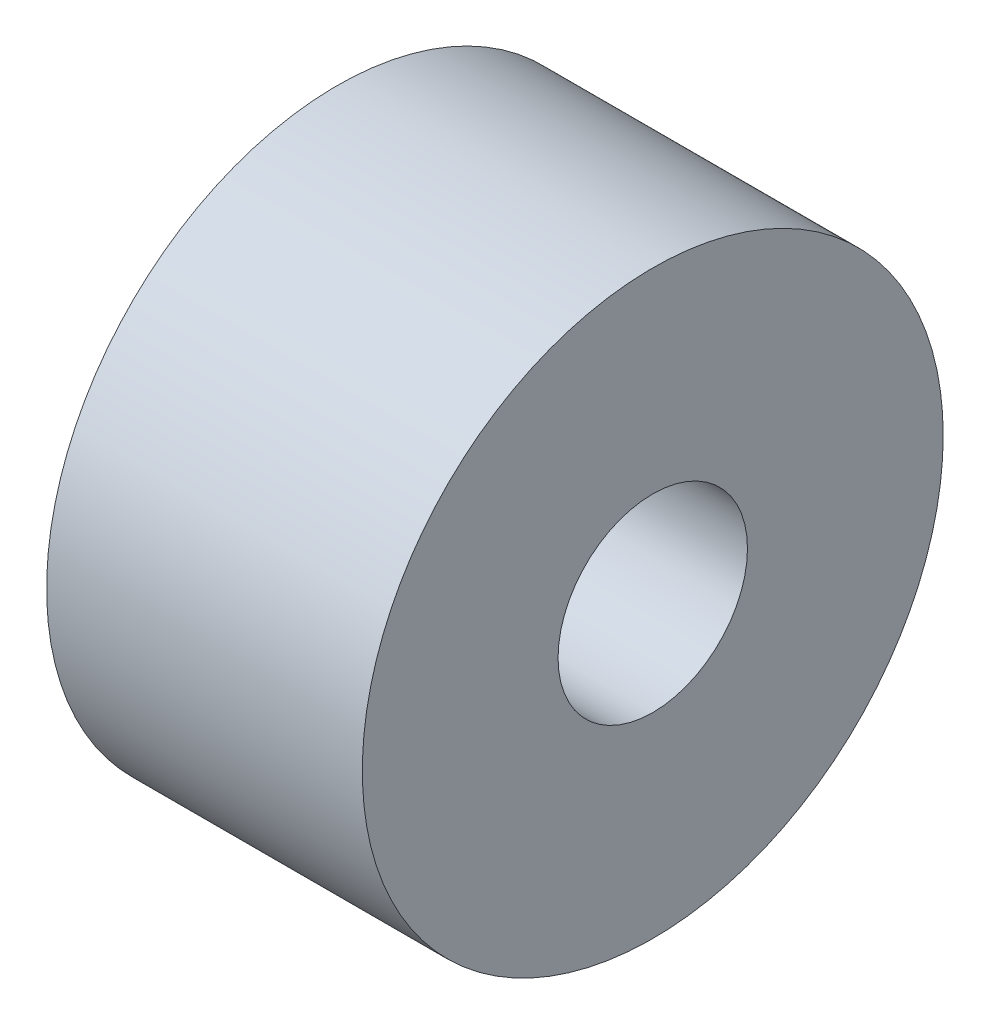
ISO-10303-21;
HEADER;
FILE_DESCRIPTION(('STEP AP214'),'2;1');
FILE_NAME('part.step','',(''),(''),'','','');
FILE_SCHEMA(('AUTOMOTIVE_DESIGN { 1 0 10303 214 1 1 1 1 }'));
ENDSEC;
DATA;
#1=APPLICATION_CONTEXT('core data for automotive mechanical design processes');
#2=APPLICATION_PROTOCOL_DEFINITION('international standard','automotive_design',2000,#1);
#3=PRODUCT_CONTEXT('',#1,'mechanical');
#4=PRODUCT('Part','Part','',(#3));
#5=PRODUCT_RELATED_PRODUCT_CATEGORY('part','',(#4));
#6=PRODUCT_DEFINITION_FORMATION('','',#4);
#7=PRODUCT_DEFINITION_CONTEXT('part definition',#1,'design');
#8=PRODUCT_DEFINITION('design','',#6,#7);
#9=PRODUCT_DEFINITION_SHAPE('','',#8);
#10=(LENGTH_UNIT() NAMED_UNIT(*) SI_UNIT(.MILLI.,.METRE.));
#11=(NAMED_UNIT(*) PLANE_ANGLE_UNIT() SI_UNIT($,.RADIAN.));
#12=(NAMED_UNIT(*) SI_UNIT($,.STERADIAN.) SOLID_ANGLE_UNIT());
#13=UNCERTAINTY_MEASURE_WITH_UNIT(LENGTH_MEASURE(1.E-05),#10,'distance_accuracy_value','');
#14=(GEOMETRIC_REPRESENTATION_CONTEXT(3) GLOBAL_UNCERTAINTY_ASSIGNED_CONTEXT((#13)) GLOBAL_UNIT_ASSIGNED_CONTEXT((#10,
#11,#12)) REPRESENTATION_CONTEXT('',''));
#15=CARTESIAN_POINT('',(0.,0.,0.));
#16=DIRECTION('',(0.,0.,1.));
#17=DIRECTION('',(1.,0.,0.));
#18=AXIS2_PLACEMENT_3D('',#15,#16,#17);
#19=CARTESIAN_POINT('',(5.,0.,0.));
#20=DIRECTION('',(1.,0.,0.));
#21=DIRECTION('',(0.,0.,-1.));
#22=AXIS2_PLACEMENT_3D('',#19,#20,#21);
#23=PLANE('',#22);
#24=CARTESIAN_POINT('',(5.,0.,0.));
#25=DIRECTION('',(1.,0.,0.));
#26=DIRECTION('',(0.,0.,-1.));
#27=AXIS2_PLACEMENT_3D('',#24,#25,#26);
#28=CIRCLE('',#27,4.6);
#29=CARTESIAN_POINT('',(5.,0.,-4.6));
#30=VERTEX_POINT('',#29);
#31=EDGE_CURVE('E10',#30,#30,#28,.T.);
#32=ORIENTED_EDGE('',*,*,#31,.T.);
#33=EDGE_LOOP('',(#32));
#34=FACE_BOUND('',#33,.T.);
#35=CARTESIAN_POINT('',(5.,0.,0.));
#36=DIRECTION('',(1.,0.,0.));
#37=DIRECTION('',(0.,0.,-1.));
#38=AXIS2_PLACEMENT_3D('',#35,#36,#37);
#39=CIRCLE('',#38,1.5);
#40=CARTESIAN_POINT('',(5.,0.,-1.5));
#41=VERTEX_POINT('',#40);
#42=EDGE_CURVE('E41',#41,#41,#39,.T.);
#43=ORIENTED_EDGE('',*,*,#42,.F.);
#44=EDGE_LOOP('',(#43));
#45=FACE_BOUND('',#44,.T.);
#46=ADVANCED_FACE('F30',(#34,#45),#23,.T.);
#47=CARTESIAN_POINT('',(0.,0.,0.));
#48=DIRECTION('',(1.,0.,0.));
#49=DIRECTION('',(0.,0.,-1.));
#50=AXIS2_PLACEMENT_3D('',#47,#48,#49);
#51=PLANE('',#50);
#52=CARTESIAN_POINT('',(0.,0.,0.));
#53=DIRECTION('',(1.,0.,0.));
#54=DIRECTION('',(0.,0.,-1.));
#55=AXIS2_PLACEMENT_3D('',#52,#53,#54);
#56=CIRCLE('',#55,4.6);
#57=CARTESIAN_POINT('',(0.,0.,-4.6));
#58=VERTEX_POINT('',#57);
#59=EDGE_CURVE('E34',#58,#58,#56,.T.);
#60=ORIENTED_EDGE('',*,*,#59,.F.);
#61=EDGE_LOOP('',(#60));
#62=FACE_BOUND('',#61,.T.);
#63=CARTESIAN_POINT('',(0.,0.,0.));
#64=DIRECTION('',(1.,0.,0.));
#65=DIRECTION('',(0.,0.,-1.));
#66=AXIS2_PLACEMENT_3D('',#63,#64,#65);
#67=CIRCLE('',#66,1.5);
#68=CARTESIAN_POINT('',(0.,0.,-1.5));
#69=VERTEX_POINT('',#68);
#70=EDGE_CURVE('E43',#69,#69,#67,.T.);
#71=ORIENTED_EDGE('',*,*,#70,.T.);
#72=EDGE_LOOP('',(#71));
#73=FACE_BOUND('',#72,.T.);
#74=ADVANCED_FACE('F53',(#62,#73),#51,.F.);
#75=CARTESIAN_POINT('',(5.,0.,0.));
#76=DIRECTION('',(-1.,0.,0.));
#77=DIRECTION('',(0.,0.,1.));
#78=AXIS2_PLACEMENT_3D('',#75,#76,#77);
#79=CYLINDRICAL_SURFACE('',#78,4.6);
#80=ORIENTED_EDGE('',*,*,#31,.F.);
#81=EDGE_LOOP('',(#80));
#82=FACE_BOUND('',#81,.T.);
#83=ORIENTED_EDGE('',*,*,#59,.T.);
#84=EDGE_LOOP('',(#83));
#85=FACE_BOUND('',#84,.T.);
#86=ADVANCED_FACE('F32',(#82,#85),#79,.T.);
#87=CARTESIAN_POINT('',(5.,0.,0.));
#88=DIRECTION('',(-1.,0.,0.));
#89=DIRECTION('',(0.,0.,1.));
#90=AXIS2_PLACEMENT_3D('',#87,#88,#89);
#91=CYLINDRICAL_SURFACE('',#90,1.5);
#92=ORIENTED_EDGE('',*,*,#42,.T.);
#93=EDGE_LOOP('',(#92));
#94=FACE_BOUND('',#93,.T.);
#95=ORIENTED_EDGE('',*,*,#70,.F.);
#96=EDGE_LOOP('',(#95));
#97=FACE_BOUND('',#96,.T.);
#98=ADVANCED_FACE('F49',(#94,#97),#91,.F.);
#99=CLOSED_SHELL('',(#46,#74,#86,#98));
#100=MANIFOLD_SOLID_BREP('B2',#99);
#101=ADVANCED_BREP_SHAPE_REPRESENTATION('',(#18,#100),#14);
#102=SHAPE_DEFINITION_REPRESENTATION(#9,#101);
ENDSEC;
END-ISO-10303-21;
